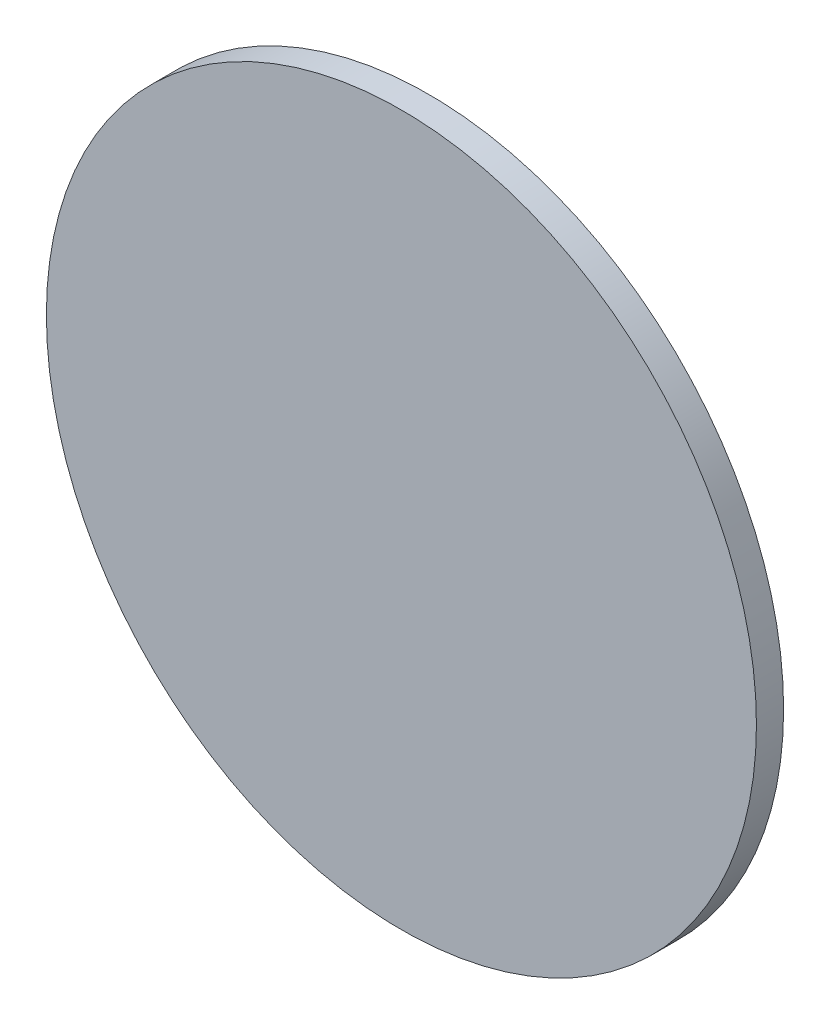
ISO-10303-21;
HEADER;
FILE_DESCRIPTION(('STEP AP214'),'2;1');
FILE_NAME('part.step','',(''),(''),'','','');
FILE_SCHEMA(('AUTOMOTIVE_DESIGN { 1 0 10303 214 1 1 1 1 }'));
ENDSEC;
DATA;
#1=APPLICATION_CONTEXT('core data for automotive mechanical design processes');
#2=APPLICATION_PROTOCOL_DEFINITION('international standard','automotive_design',2000,#1);
#3=PRODUCT_CONTEXT('',#1,'mechanical');
#4=PRODUCT('Part','Part','',(#3));
#5=PRODUCT_RELATED_PRODUCT_CATEGORY('part','',(#4));
#6=PRODUCT_DEFINITION_FORMATION('','',#4);
#7=PRODUCT_DEFINITION_CONTEXT('part definition',#1,'design');
#8=PRODUCT_DEFINITION('design','',#6,#7);
#9=PRODUCT_DEFINITION_SHAPE('','',#8);
#10=(LENGTH_UNIT() NAMED_UNIT(*) SI_UNIT(.MILLI.,.METRE.));
#11=(NAMED_UNIT(*) PLANE_ANGLE_UNIT() SI_UNIT($,.RADIAN.));
#12=(NAMED_UNIT(*) SI_UNIT($,.STERADIAN.) SOLID_ANGLE_UNIT());
#13=UNCERTAINTY_MEASURE_WITH_UNIT(LENGTH_MEASURE(1.E-05),#10,'distance_accuracy_value','');
#14=(GEOMETRIC_REPRESENTATION_CONTEXT(3) GLOBAL_UNCERTAINTY_ASSIGNED_CONTEXT((#13)) GLOBAL_UNIT_ASSIGNED_CONTEXT((#10,
#11,#12)) REPRESENTATION_CONTEXT('',''));
#15=CARTESIAN_POINT('',(0.,0.,0.));
#16=DIRECTION('',(0.,0.,1.));
#17=DIRECTION('',(1.,0.,0.));
#18=AXIS2_PLACEMENT_3D('',#15,#16,#17);
#19=CARTESIAN_POINT('',(0.,0.,0.574));
#20=DIRECTION('',(0.,0.,-1.));
#21=DIRECTION('',(-1.,0.,0.));
#22=AXIS2_PLACEMENT_3D('',#19,#20,#21);
#23=CYLINDRICAL_SURFACE('',#22,7.5);
#24=CARTESIAN_POINT('',(0.,0.,0.574));
#25=DIRECTION('',(0.,0.,1.));
#26=DIRECTION('',(1.,0.,0.));
#27=AXIS2_PLACEMENT_3D('',#24,#25,#26);
#28=CIRCLE('',#27,7.5);
#29=CARTESIAN_POINT('',(7.5,0.,0.574));
#30=VERTEX_POINT('',#29);
#31=EDGE_CURVE('E10',#30,#30,#28,.T.);
#32=ORIENTED_EDGE('',*,*,#31,.F.);
#33=EDGE_LOOP('',(#32));
#34=FACE_BOUND('',#33,.T.);
#35=CARTESIAN_POINT('',(0.,0.,0.));
#36=DIRECTION('',(0.,0.,1.));
#37=DIRECTION('',(1.,0.,0.));
#38=AXIS2_PLACEMENT_3D('',#35,#36,#37);
#39=CIRCLE('',#38,7.5);
#40=CARTESIAN_POINT('',(7.5,0.,0.));
#41=VERTEX_POINT('',#40);
#42=EDGE_CURVE('E40',#41,#41,#39,.T.);
#43=ORIENTED_EDGE('',*,*,#42,.T.);
#44=EDGE_LOOP('',(#43));
#45=FACE_BOUND('',#44,.T.);
#46=ADVANCED_FACE('F37',(#34,#45),#23,.T.);
#47=CARTESIAN_POINT('',(0.,0.,0.574));
#48=DIRECTION('',(0.,0.,1.));
#49=DIRECTION('',(1.,0.,0.));
#50=AXIS2_PLACEMENT_3D('',#47,#48,#49);
#51=PLANE('',#50);
#52=ORIENTED_EDGE('',*,*,#31,.T.);
#53=EDGE_LOOP('',(#52));
#54=FACE_BOUND('',#53,.T.);
#55=ADVANCED_FACE('F54',(#54),#51,.T.);
#56=CARTESIAN_POINT('',(0.,0.,0.));
#57=DIRECTION('',(0.,0.,1.));
#58=DIRECTION('',(1.,0.,0.));
#59=AXIS2_PLACEMENT_3D('',#56,#57,#58);
#60=PLANE('',#59);
#61=ORIENTED_EDGE('',*,*,#42,.F.);
#62=EDGE_LOOP('',(#61));
#63=FACE_BOUND('',#62,.T.);
#64=ADVANCED_FACE('F52',(#63),#60,.F.);
#65=CLOSED_SHELL('',(#46,#55,#64));
#66=MANIFOLD_SOLID_BREP('B2',#65);
#67=ADVANCED_BREP_SHAPE_REPRESENTATION('',(#18,#66),#14);
#68=SHAPE_DEFINITION_REPRESENTATION(#9,#67);
ENDSEC;
END-ISO-10303-21;
